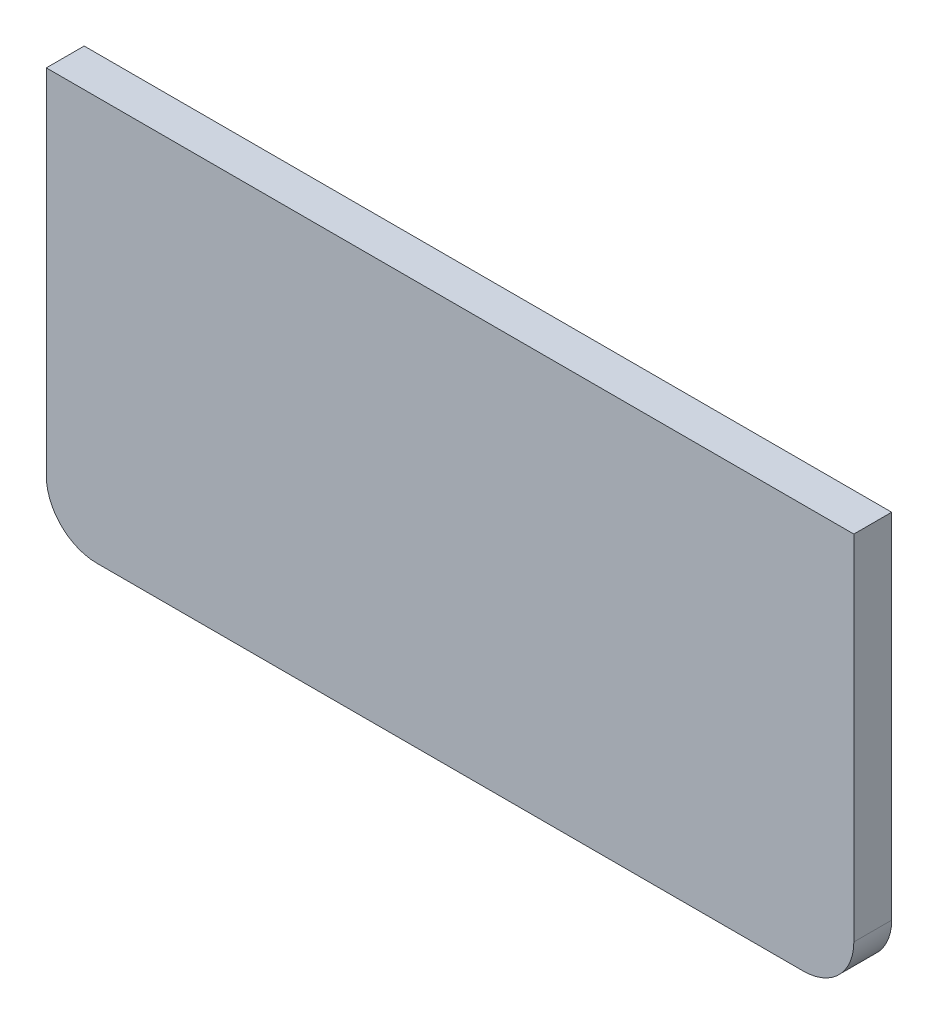
ISO-10303-21;
HEADER;
FILE_DESCRIPTION(('STEP AP214'),'2;1');
FILE_NAME('part.step','',(''),(''),'','','');
FILE_SCHEMA(('AUTOMOTIVE_DESIGN { 1 0 10303 214 1 1 1 1 }'));
ENDSEC;
DATA;
#1=APPLICATION_CONTEXT('core data for automotive mechanical design processes');
#2=APPLICATION_PROTOCOL_DEFINITION('international standard','automotive_design',2000,#1);
#3=PRODUCT_CONTEXT('',#1,'mechanical');
#4=PRODUCT('Part','Part','',(#3));
#5=PRODUCT_RELATED_PRODUCT_CATEGORY('part','',(#4));
#6=PRODUCT_DEFINITION_FORMATION('','',#4);
#7=PRODUCT_DEFINITION_CONTEXT('part definition',#1,'design');
#8=PRODUCT_DEFINITION('design','',#6,#7);
#9=PRODUCT_DEFINITION_SHAPE('','',#8);
#10=(LENGTH_UNIT() NAMED_UNIT(*) SI_UNIT(.MILLI.,.METRE.));
#11=(NAMED_UNIT(*) PLANE_ANGLE_UNIT() SI_UNIT($,.RADIAN.));
#12=(NAMED_UNIT(*) SI_UNIT($,.STERADIAN.) SOLID_ANGLE_UNIT());
#13=UNCERTAINTY_MEASURE_WITH_UNIT(LENGTH_MEASURE(1.E-05),#10,'distance_accuracy_value','');
#14=(GEOMETRIC_REPRESENTATION_CONTEXT(3) GLOBAL_UNCERTAINTY_ASSIGNED_CONTEXT((#13)) GLOBAL_UNIT_ASSIGNED_CONTEXT((#10,
#11,#12)) REPRESENTATION_CONTEXT('',''));
#15=CARTESIAN_POINT('',(0.,0.,0.));
#16=DIRECTION('',(0.,0.,1.));
#17=DIRECTION('',(1.,0.,0.));
#18=AXIS2_PLACEMENT_3D('',#15,#16,#17);
#19=CARTESIAN_POINT('',(101.6,50.8,4.7625));
#20=DIRECTION('',(-1.,0.,0.));
#21=DIRECTION('',(0.,-1.,0.));
#22=AXIS2_PLACEMENT_3D('',#19,#20,#21);
#23=PLANE('',#22);
#24=DIRECTION('',(0.,1.,0.));
#25=VECTOR('',#24,1.);
#26=CARTESIAN_POINT('',(101.6,50.8,4.7625));
#27=LINE('',#26,#25);
#28=CARTESIAN_POINT('',(101.6,-38.1,4.7625));
#29=VERTEX_POINT('',#28);
#30=CARTESIAN_POINT('',(101.6,50.8,4.7625));
#31=VERTEX_POINT('',#30);
#32=EDGE_CURVE('E86',#29,#31,#27,.T.);
#33=ORIENTED_EDGE('',*,*,#32,.F.);
#34=DIRECTION('',(0.,0.,-1.));
#35=VECTOR('',#34,1.);
#36=CARTESIAN_POINT('',(101.6,-38.1,4.7625));
#37=LINE('',#36,#35);
#38=CARTESIAN_POINT('',(101.6,-38.1,-4.7625));
#39=VERTEX_POINT('',#38);
#40=EDGE_CURVE('E109',#29,#39,#37,.T.);
#41=ORIENTED_EDGE('',*,*,#40,.T.);
#42=DIRECTION('',(0.,1.,0.));
#43=VECTOR('',#42,1.);
#44=CARTESIAN_POINT('',(101.6,50.8,-4.7625));
#45=LINE('',#44,#43);
#46=CARTESIAN_POINT('',(101.6,50.8,-4.7625));
#47=VERTEX_POINT('',#46);
#48=EDGE_CURVE('E107',#39,#47,#45,.T.);
#49=ORIENTED_EDGE('',*,*,#48,.T.);
#50=DIRECTION('',(0.,0.,-1.));
#51=VECTOR('',#50,1.);
#52=CARTESIAN_POINT('',(101.6,50.8,4.7625));
#53=LINE('',#52,#51);
#54=EDGE_CURVE('E101',#31,#47,#53,.T.);
#55=ORIENTED_EDGE('',*,*,#54,.F.);
#56=EDGE_LOOP('',(#33,#41,#49,#55));
#57=FACE_BOUND('',#56,.T.);
#58=ADVANCED_FACE('F32',(#57),#23,.F.);
#59=CARTESIAN_POINT('',(-101.6,50.8,4.7625));
#60=DIRECTION('',(0.,-1.,0.));
#61=DIRECTION('',(0.,0.,-1.));
#62=AXIS2_PLACEMENT_3D('',#59,#60,#61);
#63=PLANE('',#62);
#64=DIRECTION('',(-1.,0.,0.));
#65=VECTOR('',#64,1.);
#66=CARTESIAN_POINT('',(-101.6,50.8,-4.7625));
#67=LINE('',#66,#65);
#68=CARTESIAN_POINT('',(-101.6,50.8,-4.7625));
#69=VERTEX_POINT('',#68);
#70=EDGE_CURVE('E136',#47,#69,#67,.T.);
#71=ORIENTED_EDGE('',*,*,#70,.T.);
#72=DIRECTION('',(0.,0.,-1.));
#73=VECTOR('',#72,1.);
#74=CARTESIAN_POINT('',(-101.6,50.8,4.7625));
#75=LINE('',#74,#73);
#76=CARTESIAN_POINT('',(-101.6,50.8,4.7625));
#77=VERTEX_POINT('',#76);
#78=EDGE_CURVE('E103',#77,#69,#75,.T.);
#79=ORIENTED_EDGE('',*,*,#78,.F.);
#80=DIRECTION('',(-1.,0.,0.));
#81=VECTOR('',#80,1.);
#82=CARTESIAN_POINT('',(-101.6,50.8,4.7625));
#83=LINE('',#82,#81);
#84=EDGE_CURVE('E89',#31,#77,#83,.T.);
#85=ORIENTED_EDGE('',*,*,#84,.F.);
#86=ORIENTED_EDGE('',*,*,#54,.T.);
#87=EDGE_LOOP('',(#71,#79,#85,#86));
#88=FACE_BOUND('',#87,.T.);
#89=ADVANCED_FACE('F100',(#88),#63,.F.);
#90=CARTESIAN_POINT('',(-101.6,50.8,4.7625));
#91=DIRECTION('',(1.,0.,0.));
#92=DIRECTION('',(0.,1.,0.));
#93=AXIS2_PLACEMENT_3D('',#90,#91,#92);
#94=PLANE('',#93);
#95=DIRECTION('',(0.,-1.,0.));
#96=VECTOR('',#95,1.);
#97=CARTESIAN_POINT('',(-101.6,50.8,-4.7625));
#98=LINE('',#97,#96);
#99=CARTESIAN_POINT('',(-101.6,-38.1,-4.7625));
#100=VERTEX_POINT('',#99);
#101=EDGE_CURVE('E134',#69,#100,#98,.T.);
#102=ORIENTED_EDGE('',*,*,#101,.T.);
#103=DIRECTION('',(0.,0.,-1.));
#104=VECTOR('',#103,1.);
#105=CARTESIAN_POINT('',(-101.6,-38.1,4.7625));
#106=LINE('',#105,#104);
#107=CARTESIAN_POINT('',(-101.6,-38.1,4.7625));
#108=VERTEX_POINT('',#107);
#109=EDGE_CURVE('E11',#100,#108,#106,.F.);
#110=ORIENTED_EDGE('',*,*,#109,.T.);
#111=DIRECTION('',(0.,-1.,0.));
#112=VECTOR('',#111,1.);
#113=CARTESIAN_POINT('',(-101.6,50.8,4.7625));
#114=LINE('',#113,#112);
#115=EDGE_CURVE('E104',#77,#108,#114,.T.);
#116=ORIENTED_EDGE('',*,*,#115,.F.);
#117=ORIENTED_EDGE('',*,*,#78,.T.);
#118=EDGE_LOOP('',(#102,#110,#116,#117));
#119=FACE_BOUND('',#118,.T.);
#120=ADVANCED_FACE('F135',(#119),#94,.F.);
#121=CARTESIAN_POINT('',(-101.6,-50.8,4.7625));
#122=DIRECTION('',(0.,1.,0.));
#123=DIRECTION('',(0.,0.,1.));
#124=AXIS2_PLACEMENT_3D('',#121,#122,#123);
#125=PLANE('',#124);
#126=DIRECTION('',(1.,0.,0.));
#127=VECTOR('',#126,1.);
#128=CARTESIAN_POINT('',(-101.6,-50.8,-4.7625));
#129=LINE('',#128,#127);
#130=CARTESIAN_POINT('',(-88.9,-50.8,-4.7625));
#131=VERTEX_POINT('',#130);
#132=CARTESIAN_POINT('',(88.9,-50.8,-4.7625));
#133=VERTEX_POINT('',#132);
#134=EDGE_CURVE('E96',#131,#133,#129,.T.);
#135=ORIENTED_EDGE('',*,*,#134,.T.);
#136=DIRECTION('',(0.,0.,-1.));
#137=VECTOR('',#136,1.);
#138=CARTESIAN_POINT('',(88.9,-50.8,4.7625));
#139=LINE('',#138,#137);
#140=CARTESIAN_POINT('',(88.9,-50.8,4.7625));
#141=VERTEX_POINT('',#140);
#142=EDGE_CURVE('E53',#133,#141,#139,.F.);
#143=ORIENTED_EDGE('',*,*,#142,.T.);
#144=DIRECTION('',(1.,0.,0.));
#145=VECTOR('',#144,1.);
#146=CARTESIAN_POINT('',(-101.6,-50.8,4.7625));
#147=LINE('',#146,#145);
#148=CARTESIAN_POINT('',(-88.9,-50.8,4.7625));
#149=VERTEX_POINT('',#148);
#150=EDGE_CURVE('E113',#149,#141,#147,.T.);
#151=ORIENTED_EDGE('',*,*,#150,.F.);
#152=DIRECTION('',(0.,0.,-1.));
#153=VECTOR('',#152,1.);
#154=CARTESIAN_POINT('',(-88.9,-50.8,4.7625));
#155=LINE('',#154,#153);
#156=EDGE_CURVE('E120',#149,#131,#155,.T.);
#157=ORIENTED_EDGE('',*,*,#156,.T.);
#158=EDGE_LOOP('',(#135,#143,#151,#157));
#159=FACE_BOUND('',#158,.T.);
#160=ADVANCED_FACE('F128',(#159),#125,.F.);
#161=CARTESIAN_POINT('',(0.,0.,4.7625));
#162=DIRECTION('',(0.,0.,1.));
#163=DIRECTION('',(1.,0.,0.));
#164=AXIS2_PLACEMENT_3D('',#161,#162,#163);
#165=PLANE('',#164);
#166=ORIENTED_EDGE('',*,*,#150,.T.);
#167=CARTESIAN_POINT('',(88.9,-38.1,4.7625));
#168=DIRECTION('',(0.,0.,1.));
#169=DIRECTION('',(1.,0.,0.));
#170=AXIS2_PLACEMENT_3D('',#167,#168,#169);
#171=CIRCLE('',#170,12.7);
#172=EDGE_CURVE('E40',#141,#29,#171,.T.);
#173=ORIENTED_EDGE('',*,*,#172,.T.);
#174=ORIENTED_EDGE('',*,*,#32,.T.);
#175=ORIENTED_EDGE('',*,*,#84,.T.);
#176=ORIENTED_EDGE('',*,*,#115,.T.);
#177=CARTESIAN_POINT('',(-88.9,-38.1,4.7625));
#178=DIRECTION('',(0.,0.,1.));
#179=DIRECTION('',(1.,0.,0.));
#180=AXIS2_PLACEMENT_3D('',#177,#178,#179);
#181=CIRCLE('',#180,12.7);
#182=EDGE_CURVE('E124',#108,#149,#181,.T.);
#183=ORIENTED_EDGE('',*,*,#182,.T.);
#184=EDGE_LOOP('',(#166,#173,#174,#175,#176,#183));
#185=FACE_BOUND('',#184,.T.);
#186=ADVANCED_FACE('F88',(#185),#165,.T.);
#187=CARTESIAN_POINT('',(0.,0.,-4.7625));
#188=DIRECTION('',(0.,0.,1.));
#189=DIRECTION('',(1.,0.,0.));
#190=AXIS2_PLACEMENT_3D('',#187,#188,#189);
#191=PLANE('',#190);
#192=ORIENTED_EDGE('',*,*,#48,.F.);
#193=CARTESIAN_POINT('',(88.9,-38.1,-4.7625));
#194=DIRECTION('',(0.,0.,1.));
#195=DIRECTION('',(1.,0.,0.));
#196=AXIS2_PLACEMENT_3D('',#193,#194,#195);
#197=CIRCLE('',#196,12.7);
#198=EDGE_CURVE('E118',#39,#133,#197,.F.);
#199=ORIENTED_EDGE('',*,*,#198,.T.);
#200=ORIENTED_EDGE('',*,*,#134,.F.);
#201=CARTESIAN_POINT('',(-88.9,-38.1,-4.7625));
#202=DIRECTION('',(0.,0.,1.));
#203=DIRECTION('',(1.,0.,0.));
#204=AXIS2_PLACEMENT_3D('',#201,#202,#203);
#205=CIRCLE('',#204,12.7);
#206=EDGE_CURVE('E111',#131,#100,#205,.F.);
#207=ORIENTED_EDGE('',*,*,#206,.T.);
#208=ORIENTED_EDGE('',*,*,#101,.F.);
#209=ORIENTED_EDGE('',*,*,#70,.F.);
#210=EDGE_LOOP('',(#192,#199,#200,#207,#208,#209));
#211=FACE_BOUND('',#210,.T.);
#212=ADVANCED_FACE('F133',(#211),#191,.F.);
#213=CARTESIAN_POINT('',(88.9,-38.1,4.7625));
#214=DIRECTION('',(0.,0.,-1.));
#215=DIRECTION('',(-1.,0.,0.));
#216=AXIS2_PLACEMENT_3D('',#213,#214,#215);
#217=CYLINDRICAL_SURFACE('',#216,12.7);
#218=ORIENTED_EDGE('',*,*,#172,.F.);
#219=ORIENTED_EDGE('',*,*,#142,.F.);
#220=ORIENTED_EDGE('',*,*,#198,.F.);
#221=ORIENTED_EDGE('',*,*,#40,.F.);
#222=EDGE_LOOP('',(#218,#219,#220,#221));
#223=FACE_BOUND('',#222,.T.);
#224=ADVANCED_FACE('F142',(#223),#217,.T.);
#225=CARTESIAN_POINT('',(-88.9,-38.1,4.7625));
#226=DIRECTION('',(0.,0.,-1.));
#227=DIRECTION('',(-1.,0.,0.));
#228=AXIS2_PLACEMENT_3D('',#225,#226,#227);
#229=CYLINDRICAL_SURFACE('',#228,12.7);
#230=ORIENTED_EDGE('',*,*,#182,.F.);
#231=ORIENTED_EDGE('',*,*,#109,.F.);
#232=ORIENTED_EDGE('',*,*,#206,.F.);
#233=ORIENTED_EDGE('',*,*,#156,.F.);
#234=EDGE_LOOP('',(#230,#231,#232,#233));
#235=FACE_BOUND('',#234,.T.);
#236=ADVANCED_FACE('F34',(#235),#229,.T.);
#237=CLOSED_SHELL('',(#58,#89,#120,#160,#186,#212,#224,#236));
#238=MANIFOLD_SOLID_BREP('B2',#237);
#239=ADVANCED_BREP_SHAPE_REPRESENTATION('',(#18,#238),#14);
#240=SHAPE_DEFINITION_REPRESENTATION(#9,#239);
ENDSEC;
END-ISO-10303-21;
